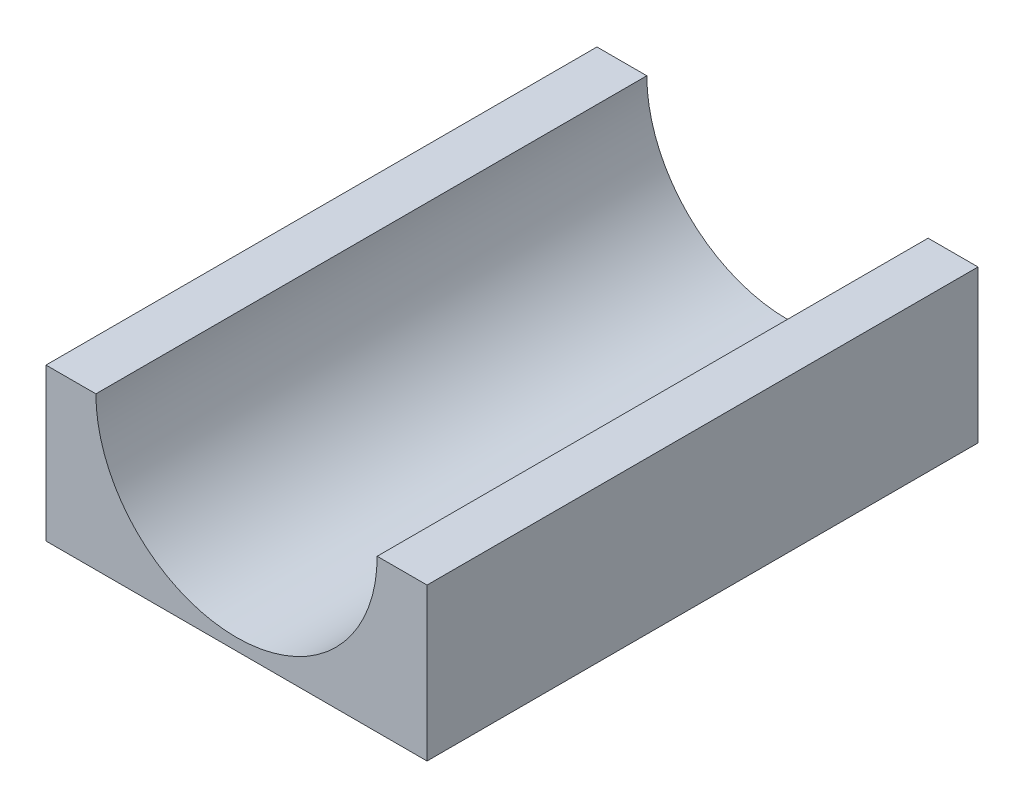
ISO-10303-21;
HEADER;
FILE_DESCRIPTION(('STEP AP214'),'2;1');
FILE_NAME('part.step','',(''),(''),'','','');
FILE_SCHEMA(('AUTOMOTIVE_DESIGN { 1 0 10303 214 1 1 1 1 }'));
ENDSEC;
DATA;
#1=APPLICATION_CONTEXT('core data for automotive mechanical design processes');
#2=APPLICATION_PROTOCOL_DEFINITION('international standard','automotive_design',2000,#1);
#3=PRODUCT_CONTEXT('',#1,'mechanical');
#4=PRODUCT('Part','Part','',(#3));
#5=PRODUCT_RELATED_PRODUCT_CATEGORY('part','',(#4));
#6=PRODUCT_DEFINITION_FORMATION('','',#4);
#7=PRODUCT_DEFINITION_CONTEXT('part definition',#1,'design');
#8=PRODUCT_DEFINITION('design','',#6,#7);
#9=PRODUCT_DEFINITION_SHAPE('','',#8);
#10=(LENGTH_UNIT() NAMED_UNIT(*) SI_UNIT(.MILLI.,.METRE.));
#11=(NAMED_UNIT(*) PLANE_ANGLE_UNIT() SI_UNIT($,.RADIAN.));
#12=(NAMED_UNIT(*) SI_UNIT($,.STERADIAN.) SOLID_ANGLE_UNIT());
#13=UNCERTAINTY_MEASURE_WITH_UNIT(LENGTH_MEASURE(1.E-05),#10,'distance_accuracy_value','');
#14=(GEOMETRIC_REPRESENTATION_CONTEXT(3) GLOBAL_UNCERTAINTY_ASSIGNED_CONTEXT((#13)) GLOBAL_UNIT_ASSIGNED_CONTEXT((#10,
#11,#12)) REPRESENTATION_CONTEXT('',''));
#15=CARTESIAN_POINT('',(0.,0.,0.));
#16=DIRECTION('',(0.,0.,1.));
#17=DIRECTION('',(1.,0.,0.));
#18=AXIS2_PLACEMENT_3D('',#15,#16,#17);
#19=CARTESIAN_POINT('',(0.,20.32,0.));
#20=DIRECTION('',(0.,1.,0.));
#21=DIRECTION('',(0.,0.,1.));
#22=AXIS2_PLACEMENT_3D('',#19,#20,#21);
#23=PLANE('',#22);
#24=DIRECTION('',(0.,0.,1.));
#25=VECTOR('',#24,1.);
#26=CARTESIAN_POINT('',(-18.749999965,20.32,-36.725999956));
#27=LINE('',#26,#25);
#28=CARTESIAN_POINT('',(-18.749999965,20.32,36.724999956));
#29=VERTEX_POINT('',#28);
#30=CARTESIAN_POINT('',(-18.749999965,20.32,-36.724999956));
#31=VERTEX_POINT('',#30);
#32=EDGE_CURVE('E108',#29,#31,#27,.F.);
#33=ORIENTED_EDGE('',*,*,#32,.T.);
#34=DIRECTION('',(-1.,0.,0.));
#35=VECTOR('',#34,1.);
#36=CARTESIAN_POINT('',(-25.4,20.32,-36.724999956));
#37=LINE('',#36,#35);
#38=CARTESIAN_POINT('',(-25.4,20.32,-36.724999956));
#39=VERTEX_POINT('',#38);
#40=EDGE_CURVE('E64',#31,#39,#37,.T.);
#41=ORIENTED_EDGE('',*,*,#40,.T.);
#42=DIRECTION('',(0.,0.,1.));
#43=VECTOR('',#42,1.);
#44=CARTESIAN_POINT('',(-25.4,20.32,-36.724999956));
#45=LINE('',#44,#43);
#46=CARTESIAN_POINT('',(-25.4,20.32,36.724999956));
#47=VERTEX_POINT('',#46);
#48=EDGE_CURVE('E140',#39,#47,#45,.T.);
#49=ORIENTED_EDGE('',*,*,#48,.T.);
#50=DIRECTION('',(1.,0.,0.));
#51=VECTOR('',#50,1.);
#52=CARTESIAN_POINT('',(-25.4,20.32,36.724999956));
#53=LINE('',#52,#51);
#54=EDGE_CURVE('E92',#47,#29,#53,.T.);
#55=ORIENTED_EDGE('',*,*,#54,.T.);
#56=EDGE_LOOP('',(#33,#41,#49,#55));
#57=FACE_BOUND('',#56,.T.);
#58=ADVANCED_FACE('F39',(#57),#23,.T.);
#59=CARTESIAN_POINT('',(-25.4,20.32,-36.724999956));
#60=DIRECTION('',(1.,0.,0.));
#61=DIRECTION('',(0.,0.,-1.));
#62=AXIS2_PLACEMENT_3D('',#59,#60,#61);
#63=PLANE('',#62);
#64=DIRECTION('',(0.,0.,1.));
#65=VECTOR('',#64,1.);
#66=CARTESIAN_POINT('',(-25.4,0.,-36.724999956));
#67=LINE('',#66,#65);
#68=CARTESIAN_POINT('',(-25.4,0.,-36.724999956));
#69=VERTEX_POINT('',#68);
#70=CARTESIAN_POINT('',(-25.4,0.,36.724999956));
#71=VERTEX_POINT('',#70);
#72=EDGE_CURVE('E114',#69,#71,#67,.T.);
#73=ORIENTED_EDGE('',*,*,#72,.T.);
#74=DIRECTION('',(0.,-1.,0.));
#75=VECTOR('',#74,1.);
#76=CARTESIAN_POINT('',(-25.4,20.32,36.724999956));
#77=LINE('',#76,#75);
#78=EDGE_CURVE('E11',#47,#71,#77,.T.);
#79=ORIENTED_EDGE('',*,*,#78,.F.);
#80=ORIENTED_EDGE('',*,*,#48,.F.);
#81=DIRECTION('',(0.,-1.,0.));
#82=VECTOR('',#81,1.);
#83=CARTESIAN_POINT('',(-25.4,20.32,-36.724999956));
#84=LINE('',#83,#82);
#85=EDGE_CURVE('E121',#39,#69,#84,.T.);
#86=ORIENTED_EDGE('',*,*,#85,.T.);
#87=EDGE_LOOP('',(#73,#79,#80,#86));
#88=FACE_BOUND('',#87,.T.);
#89=ADVANCED_FACE('F41',(#88),#63,.F.);
#90=CARTESIAN_POINT('',(-25.4,20.32,36.724999956));
#91=DIRECTION('',(0.,0.,-1.));
#92=DIRECTION('',(-1.,0.,0.));
#93=AXIS2_PLACEMENT_3D('',#90,#91,#92);
#94=PLANE('',#93);
#95=CARTESIAN_POINT('',(18.749999965,20.32,36.724999956));
#96=VERTEX_POINT('',#95);
#97=CARTESIAN_POINT('',(25.4,20.32,36.724999956));
#98=VERTEX_POINT('',#97);
#99=EDGE_CURVE('E156',#96,#98,#53,.T.);
#100=ORIENTED_EDGE('',*,*,#99,.F.);
#101=CARTESIAN_POINT('',(0.,20.32,36.724999956));
#102=DIRECTION('',(0.,0.,1.));
#103=DIRECTION('',(1.,0.,0.));
#104=AXIS2_PLACEMENT_3D('',#101,#102,#103);
#105=CIRCLE('',#104,18.749999965);
#106=EDGE_CURVE('E55',#29,#96,#105,.T.);
#107=ORIENTED_EDGE('',*,*,#106,.F.);
#108=ORIENTED_EDGE('',*,*,#54,.F.);
#109=ORIENTED_EDGE('',*,*,#78,.T.);
#110=DIRECTION('',(1.,0.,0.));
#111=VECTOR('',#110,1.);
#112=CARTESIAN_POINT('',(-25.4,0.,36.724999956));
#113=LINE('',#112,#111);
#114=CARTESIAN_POINT('',(25.4,0.,36.724999956));
#115=VERTEX_POINT('',#114);
#116=EDGE_CURVE('E133',#71,#115,#113,.T.);
#117=ORIENTED_EDGE('',*,*,#116,.T.);
#118=DIRECTION('',(0.,-1.,0.));
#119=VECTOR('',#118,1.);
#120=CARTESIAN_POINT('',(25.4,20.32,36.724999956));
#121=LINE('',#120,#119);
#122=EDGE_CURVE('E48',#98,#115,#121,.T.);
#123=ORIENTED_EDGE('',*,*,#122,.F.);
#124=EDGE_LOOP('',(#100,#107,#108,#109,#117,#123));
#125=FACE_BOUND('',#124,.T.);
#126=ADVANCED_FACE('F165',(#125),#94,.F.);
#127=CARTESIAN_POINT('',(25.4,20.32,-36.724999956));
#128=DIRECTION('',(-1.,0.,0.));
#129=DIRECTION('',(0.,0.,1.));
#130=AXIS2_PLACEMENT_3D('',#127,#128,#129);
#131=PLANE('',#130);
#132=DIRECTION('',(0.,0.,-1.));
#133=VECTOR('',#132,1.);
#134=CARTESIAN_POINT('',(25.4,0.,-36.724999956));
#135=LINE('',#134,#133);
#136=CARTESIAN_POINT('',(25.4,0.,-36.724999956));
#137=VERTEX_POINT('',#136);
#138=EDGE_CURVE('E136',#115,#137,#135,.T.);
#139=ORIENTED_EDGE('',*,*,#138,.T.);
#140=DIRECTION('',(0.,-1.,0.));
#141=VECTOR('',#140,1.);
#142=CARTESIAN_POINT('',(25.4,20.32,-36.724999956));
#143=LINE('',#142,#141);
#144=CARTESIAN_POINT('',(25.4,20.32,-36.724999956));
#145=VERTEX_POINT('',#144);
#146=EDGE_CURVE('E125',#145,#137,#143,.T.);
#147=ORIENTED_EDGE('',*,*,#146,.F.);
#148=DIRECTION('',(0.,0.,-1.));
#149=VECTOR('',#148,1.);
#150=CARTESIAN_POINT('',(25.4,20.32,-36.724999956));
#151=LINE('',#150,#149);
#152=EDGE_CURVE('E118',#98,#145,#151,.T.);
#153=ORIENTED_EDGE('',*,*,#152,.F.);
#154=ORIENTED_EDGE('',*,*,#122,.T.);
#155=EDGE_LOOP('',(#139,#147,#153,#154));
#156=FACE_BOUND('',#155,.T.);
#157=ADVANCED_FACE('F148',(#156),#131,.F.);
#158=CARTESIAN_POINT('',(-25.4,20.32,-36.724999956));
#159=DIRECTION('',(0.,0.,1.));
#160=DIRECTION('',(1.,0.,0.));
#161=AXIS2_PLACEMENT_3D('',#158,#159,#160);
#162=PLANE('',#161);
#163=ORIENTED_EDGE('',*,*,#40,.F.);
#164=CARTESIAN_POINT('',(0.,20.32,-36.724999956));
#165=DIRECTION('',(0.,0.,1.));
#166=DIRECTION('',(1.,0.,0.));
#167=AXIS2_PLACEMENT_3D('',#164,#165,#166);
#168=CIRCLE('',#167,18.749999965);
#169=CARTESIAN_POINT('',(18.749999965,20.32,-36.724999956));
#170=VERTEX_POINT('',#169);
#171=EDGE_CURVE('E103',#170,#31,#168,.F.);
#172=ORIENTED_EDGE('',*,*,#171,.F.);
#173=EDGE_CURVE('E112',#145,#170,#37,.T.);
#174=ORIENTED_EDGE('',*,*,#173,.F.);
#175=ORIENTED_EDGE('',*,*,#146,.T.);
#176=DIRECTION('',(-1.,0.,0.));
#177=VECTOR('',#176,1.);
#178=CARTESIAN_POINT('',(-25.4,0.,-36.724999956));
#179=LINE('',#178,#177);
#180=EDGE_CURVE('E86',#137,#69,#179,.T.);
#181=ORIENTED_EDGE('',*,*,#180,.T.);
#182=ORIENTED_EDGE('',*,*,#85,.F.);
#183=EDGE_LOOP('',(#163,#172,#174,#175,#181,#182));
#184=FACE_BOUND('',#183,.T.);
#185=ADVANCED_FACE('F111',(#184),#162,.F.);
#186=DIRECTION('',(0.,0.,1.));
#187=VECTOR('',#186,1.);
#188=CARTESIAN_POINT('',(18.749999965,20.32,-36.725999956));
#189=LINE('',#188,#187);
#190=EDGE_CURVE('E100',#170,#96,#189,.T.);
#191=ORIENTED_EDGE('',*,*,#190,.T.);
#192=ORIENTED_EDGE('',*,*,#99,.T.);
#193=ORIENTED_EDGE('',*,*,#152,.T.);
#194=ORIENTED_EDGE('',*,*,#173,.T.);
#195=EDGE_LOOP('',(#191,#192,#193,#194));
#196=FACE_BOUND('',#195,.T.);
#197=ADVANCED_FACE('F116',(#196),#23,.T.);
#198=CARTESIAN_POINT('',(0.,0.,0.));
#199=DIRECTION('',(0.,1.,0.));
#200=DIRECTION('',(0.,0.,1.));
#201=AXIS2_PLACEMENT_3D('',#198,#199,#200);
#202=PLANE('',#201);
#203=ORIENTED_EDGE('',*,*,#72,.F.);
#204=ORIENTED_EDGE('',*,*,#180,.F.);
#205=ORIENTED_EDGE('',*,*,#138,.F.);
#206=ORIENTED_EDGE('',*,*,#116,.F.);
#207=EDGE_LOOP('',(#203,#204,#205,#206));
#208=FACE_BOUND('',#207,.T.);
#209=ADVANCED_FACE('F151',(#208),#202,.F.);
#210=CARTESIAN_POINT('',(0.,20.32,-36.725999956));
#211=DIRECTION('',(0.,0.,1.));
#212=DIRECTION('',(1.,0.,0.));
#213=AXIS2_PLACEMENT_3D('',#210,#211,#212);
#214=CYLINDRICAL_SURFACE('',#213,18.749999965);
#215=ORIENTED_EDGE('',*,*,#106,.T.);
#216=ORIENTED_EDGE('',*,*,#190,.F.);
#217=ORIENTED_EDGE('',*,*,#171,.T.);
#218=ORIENTED_EDGE('',*,*,#32,.F.);
#219=EDGE_LOOP('',(#215,#216,#217,#218));
#220=FACE_BOUND('',#219,.T.);
#221=ADVANCED_FACE('F102',(#220),#214,.F.);
#222=CLOSED_SHELL('',(#58,#89,#126,#157,#185,#197,#209,#221));
#223=MANIFOLD_SOLID_BREP('B2',#222);
#224=ADVANCED_BREP_SHAPE_REPRESENTATION('',(#18,#223),#14);
#225=SHAPE_DEFINITION_REPRESENTATION(#9,#224);
ENDSEC;
END-ISO-10303-21;
